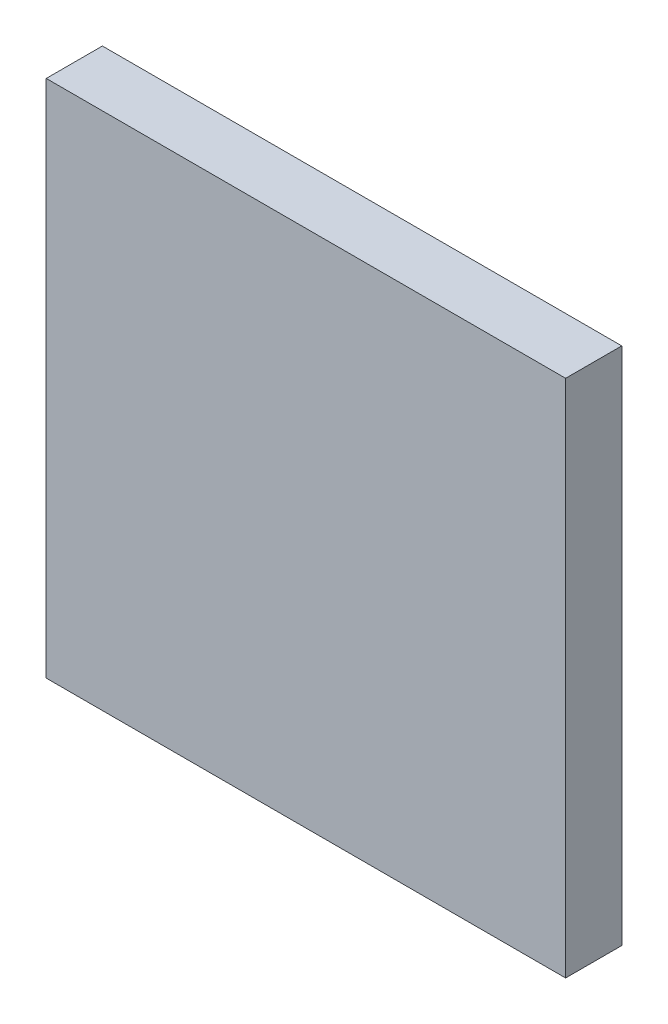
ISO-10303-21;
HEADER;
FILE_DESCRIPTION(('STEP AP214'),'2;1');
FILE_NAME('part.step','',(''),(''),'','','');
FILE_SCHEMA(('AUTOMOTIVE_DESIGN { 1 0 10303 214 1 1 1 1 }'));
ENDSEC;
DATA;
#1=APPLICATION_CONTEXT('core data for automotive mechanical design processes');
#2=APPLICATION_PROTOCOL_DEFINITION('international standard','automotive_design',2000,#1);
#3=PRODUCT_CONTEXT('',#1,'mechanical');
#4=PRODUCT('Part','Part','',(#3));
#5=PRODUCT_RELATED_PRODUCT_CATEGORY('part','',(#4));
#6=PRODUCT_DEFINITION_FORMATION('','',#4);
#7=PRODUCT_DEFINITION_CONTEXT('part definition',#1,'design');
#8=PRODUCT_DEFINITION('design','',#6,#7);
#9=PRODUCT_DEFINITION_SHAPE('','',#8);
#10=(LENGTH_UNIT() NAMED_UNIT(*) SI_UNIT(.MILLI.,.METRE.));
#11=(NAMED_UNIT(*) PLANE_ANGLE_UNIT() SI_UNIT($,.RADIAN.));
#12=(NAMED_UNIT(*) SI_UNIT($,.STERADIAN.) SOLID_ANGLE_UNIT());
#13=UNCERTAINTY_MEASURE_WITH_UNIT(LENGTH_MEASURE(1.E-05),#10,'distance_accuracy_value','');
#14=(GEOMETRIC_REPRESENTATION_CONTEXT(3) GLOBAL_UNCERTAINTY_ASSIGNED_CONTEXT((#13)) GLOBAL_UNIT_ASSIGNED_CONTEXT((#10,
#11,#12)) REPRESENTATION_CONTEXT('',''));
#15=CARTESIAN_POINT('',(0.,0.,0.));
#16=DIRECTION('',(0.,0.,1.));
#17=DIRECTION('',(1.,0.,0.));
#18=AXIS2_PLACEMENT_3D('',#15,#16,#17);
#19=CARTESIAN_POINT('',(-6.89408076878242,16.3185492801772,4.));
#20=DIRECTION('',(1.,0.,0.));
#21=DIRECTION('',(0.,1.,0.));
#22=AXIS2_PLACEMENT_3D('',#19,#20,#21);
#23=PLANE('',#22);
#24=DIRECTION('',(0.,-1.,0.));
#25=VECTOR('',#24,1.);
#26=CARTESIAN_POINT('',(-6.89408076878242,16.3185492801772,0.));
#27=LINE('',#26,#25);
#28=CARTESIAN_POINT('',(-6.89408076878242,16.3185492801772,0.));
#29=VERTEX_POINT('',#28);
#30=CARTESIAN_POINT('',(-6.89408076878242,-20.6814507198228,0.));
#31=VERTEX_POINT('',#30);
#32=EDGE_CURVE('E96',#29,#31,#27,.T.);
#33=ORIENTED_EDGE('',*,*,#32,.T.);
#34=DIRECTION('',(0.,0.,-1.));
#35=VECTOR('',#34,1.);
#36=CARTESIAN_POINT('',(-6.89408076878242,-20.6814507198228,4.));
#37=LINE('',#36,#35);
#38=CARTESIAN_POINT('',(-6.89408076878242,-20.6814507198228,4.));
#39=VERTEX_POINT('',#38);
#40=EDGE_CURVE('E11',#39,#31,#37,.T.);
#41=ORIENTED_EDGE('',*,*,#40,.F.);
#42=DIRECTION('',(0.,-1.,0.));
#43=VECTOR('',#42,1.);
#44=CARTESIAN_POINT('',(-6.89408076878242,16.3185492801772,4.));
#45=LINE('',#44,#43);
#46=CARTESIAN_POINT('',(-6.89408076878242,16.3185492801772,4.));
#47=VERTEX_POINT('',#46);
#48=EDGE_CURVE('E84',#47,#39,#45,.T.);
#49=ORIENTED_EDGE('',*,*,#48,.F.);
#50=DIRECTION('',(0.,0.,-1.));
#51=VECTOR('',#50,1.);
#52=CARTESIAN_POINT('',(-6.89408076878242,16.3185492801772,4.));
#53=LINE('',#52,#51);
#54=EDGE_CURVE('E92',#47,#29,#53,.T.);
#55=ORIENTED_EDGE('',*,*,#54,.T.);
#56=EDGE_LOOP('',(#33,#41,#49,#55));
#57=FACE_BOUND('',#56,.T.);
#58=ADVANCED_FACE('F33',(#57),#23,.F.);
#59=CARTESIAN_POINT('',(-6.89408076878242,-20.6814507198228,4.));
#60=DIRECTION('',(0.,1.,0.));
#61=DIRECTION('',(0.,0.,1.));
#62=AXIS2_PLACEMENT_3D('',#59,#60,#61);
#63=PLANE('',#62);
#64=DIRECTION('',(1.,0.,0.));
#65=VECTOR('',#64,1.);
#66=CARTESIAN_POINT('',(-6.89408076878242,-20.6814507198228,0.));
#67=LINE('',#66,#65);
#68=CARTESIAN_POINT('',(30.1059192312176,-20.6814507198228,0.));
#69=VERTEX_POINT('',#68);
#70=EDGE_CURVE('E88',#31,#69,#67,.T.);
#71=ORIENTED_EDGE('',*,*,#70,.T.);
#72=DIRECTION('',(0.,0.,-1.));
#73=VECTOR('',#72,1.);
#74=CARTESIAN_POINT('',(30.1059192312176,-20.6814507198228,4.));
#75=LINE('',#74,#73);
#76=CARTESIAN_POINT('',(30.1059192312176,-20.6814507198228,4.));
#77=VERTEX_POINT('',#76);
#78=EDGE_CURVE('E41',#77,#69,#75,.T.);
#79=ORIENTED_EDGE('',*,*,#78,.F.);
#80=DIRECTION('',(1.,0.,0.));
#81=VECTOR('',#80,1.);
#82=CARTESIAN_POINT('',(-6.89408076878242,-20.6814507198228,4.));
#83=LINE('',#82,#81);
#84=EDGE_CURVE('E79',#39,#77,#83,.T.);
#85=ORIENTED_EDGE('',*,*,#84,.F.);
#86=ORIENTED_EDGE('',*,*,#40,.T.);
#87=EDGE_LOOP('',(#71,#79,#85,#86));
#88=FACE_BOUND('',#87,.T.);
#89=ADVANCED_FACE('F87',(#88),#63,.F.);
#90=CARTESIAN_POINT('',(30.1059192312176,16.3185492801772,4.));
#91=DIRECTION('',(-1.,0.,0.));
#92=DIRECTION('',(0.,0.,1.));
#93=AXIS2_PLACEMENT_3D('',#90,#91,#92);
#94=PLANE('',#93);
#95=DIRECTION('',(0.,1.,0.));
#96=VECTOR('',#95,1.);
#97=CARTESIAN_POINT('',(30.1059192312176,16.3185492801772,0.));
#98=LINE('',#97,#96);
#99=CARTESIAN_POINT('',(30.1059192312176,16.3185492801772,0.));
#100=VERTEX_POINT('',#99);
#101=EDGE_CURVE('E66',#69,#100,#98,.T.);
#102=ORIENTED_EDGE('',*,*,#101,.T.);
#103=DIRECTION('',(0.,0.,-1.));
#104=VECTOR('',#103,1.);
#105=CARTESIAN_POINT('',(30.1059192312176,16.3185492801772,4.));
#106=LINE('',#105,#104);
#107=CARTESIAN_POINT('',(30.1059192312176,16.3185492801772,4.));
#108=VERTEX_POINT('',#107);
#109=EDGE_CURVE('E89',#108,#100,#106,.T.);
#110=ORIENTED_EDGE('',*,*,#109,.F.);
#111=DIRECTION('',(0.,1.,0.));
#112=VECTOR('',#111,1.);
#113=CARTESIAN_POINT('',(30.1059192312176,16.3185492801772,4.));
#114=LINE('',#113,#112);
#115=EDGE_CURVE('E82',#77,#108,#114,.T.);
#116=ORIENTED_EDGE('',*,*,#115,.F.);
#117=ORIENTED_EDGE('',*,*,#78,.T.);
#118=EDGE_LOOP('',(#102,#110,#116,#117));
#119=FACE_BOUND('',#118,.T.);
#120=ADVANCED_FACE('F90',(#119),#94,.F.);
#121=CARTESIAN_POINT('',(-6.89408076878242,16.3185492801772,4.));
#122=DIRECTION('',(0.,-1.,0.));
#123=DIRECTION('',(0.,0.,-1.));
#124=AXIS2_PLACEMENT_3D('',#121,#122,#123);
#125=PLANE('',#124);
#126=DIRECTION('',(-1.,0.,0.));
#127=VECTOR('',#126,1.);
#128=CARTESIAN_POINT('',(-6.89408076878242,16.3185492801772,0.));
#129=LINE('',#128,#127);
#130=EDGE_CURVE('E72',#100,#29,#129,.T.);
#131=ORIENTED_EDGE('',*,*,#130,.T.);
#132=ORIENTED_EDGE('',*,*,#54,.F.);
#133=DIRECTION('',(-1.,0.,0.));
#134=VECTOR('',#133,1.);
#135=CARTESIAN_POINT('',(-6.89408076878242,16.3185492801772,4.));
#136=LINE('',#135,#134);
#137=EDGE_CURVE('E49',#108,#47,#136,.T.);
#138=ORIENTED_EDGE('',*,*,#137,.F.);
#139=ORIENTED_EDGE('',*,*,#109,.T.);
#140=EDGE_LOOP('',(#131,#132,#138,#139));
#141=FACE_BOUND('',#140,.T.);
#142=ADVANCED_FACE('F103',(#141),#125,.F.);
#143=CARTESIAN_POINT('',(0.,0.,4.));
#144=DIRECTION('',(0.,0.,1.));
#145=DIRECTION('',(1.,0.,0.));
#146=AXIS2_PLACEMENT_3D('',#143,#144,#145);
#147=PLANE('',#146);
#148=ORIENTED_EDGE('',*,*,#48,.T.);
#149=ORIENTED_EDGE('',*,*,#84,.T.);
#150=ORIENTED_EDGE('',*,*,#115,.T.);
#151=ORIENTED_EDGE('',*,*,#137,.T.);
#152=EDGE_LOOP('',(#148,#149,#150,#151));
#153=FACE_BOUND('',#152,.T.);
#154=ADVANCED_FACE('F80',(#153),#147,.T.);
#155=CARTESIAN_POINT('',(0.,0.,0.));
#156=DIRECTION('',(0.,0.,1.));
#157=DIRECTION('',(1.,0.,0.));
#158=AXIS2_PLACEMENT_3D('',#155,#156,#157);
#159=PLANE('',#158);
#160=ORIENTED_EDGE('',*,*,#32,.F.);
#161=ORIENTED_EDGE('',*,*,#130,.F.);
#162=ORIENTED_EDGE('',*,*,#101,.F.);
#163=ORIENTED_EDGE('',*,*,#70,.F.);
#164=EDGE_LOOP('',(#160,#161,#162,#163));
#165=FACE_BOUND('',#164,.T.);
#166=ADVANCED_FACE('F106',(#165),#159,.F.);
#167=CLOSED_SHELL('',(#58,#89,#120,#142,#154,#166));
#168=MANIFOLD_SOLID_BREP('B2',#167);
#169=ADVANCED_BREP_SHAPE_REPRESENTATION('',(#18,#168),#14);
#170=SHAPE_DEFINITION_REPRESENTATION(#9,#169);
ENDSEC;
END-ISO-10303-21;
